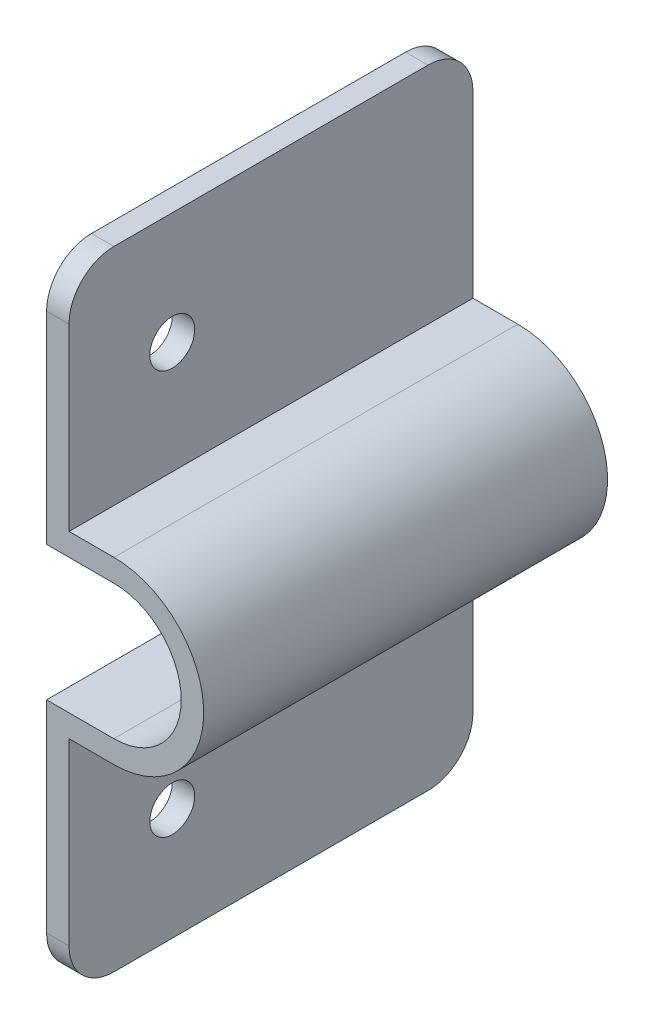
ISO-10303-21;
HEADER;
FILE_DESCRIPTION(('STEP AP214'),'2;1');
FILE_NAME('part.step','',(''),(''),'','','');
FILE_SCHEMA(('AUTOMOTIVE_DESIGN { 1 0 10303 214 1 1 1 1 }'));
ENDSEC;
DATA;
#1=APPLICATION_CONTEXT('core data for automotive mechanical design processes');
#2=APPLICATION_PROTOCOL_DEFINITION('international standard','automotive_design',2000,#1);
#3=PRODUCT_CONTEXT('',#1,'mechanical');
#4=PRODUCT('Part','Part','',(#3));
#5=PRODUCT_RELATED_PRODUCT_CATEGORY('part','',(#4));
#6=PRODUCT_DEFINITION_FORMATION('','',#4);
#7=PRODUCT_DEFINITION_CONTEXT('part definition',#1,'design');
#8=PRODUCT_DEFINITION('design','',#6,#7);
#9=PRODUCT_DEFINITION_SHAPE('','',#8);
#10=(LENGTH_UNIT() NAMED_UNIT(*) SI_UNIT(.MILLI.,.METRE.));
#11=(NAMED_UNIT(*) PLANE_ANGLE_UNIT() SI_UNIT($,.RADIAN.));
#12=(NAMED_UNIT(*) SI_UNIT($,.STERADIAN.) SOLID_ANGLE_UNIT());
#13=UNCERTAINTY_MEASURE_WITH_UNIT(LENGTH_MEASURE(1.E-05),#10,'distance_accuracy_value','');
#14=(GEOMETRIC_REPRESENTATION_CONTEXT(3) GLOBAL_UNCERTAINTY_ASSIGNED_CONTEXT((#13)) GLOBAL_UNIT_ASSIGNED_CONTEXT((#10,
#11,#12)) REPRESENTATION_CONTEXT('',''));
#15=CARTESIAN_POINT('',(0.,0.,0.));
#16=DIRECTION('',(0.,0.,1.));
#17=DIRECTION('',(1.,0.,0.));
#18=AXIS2_PLACEMENT_3D('',#15,#16,#17);
#19=CARTESIAN_POINT('',(0.,288.164397321974,-88.9));
#20=DIRECTION('',(0.,1.,0.));
#21=DIRECTION('',(0.,0.,1.));
#22=AXIS2_PLACEMENT_3D('',#19,#20,#21);
#23=PLANE('',#22);
#24=DIRECTION('',(1.,0.,0.));
#25=VECTOR('',#24,1.);
#26=CARTESIAN_POINT('',(0.,288.164397321974,-31.75));
#27=LINE('',#26,#25);
#28=CARTESIAN_POINT('',(10.1599999999996,288.164397321974,-31.75));
#29=VERTEX_POINT('',#28);
#30=CARTESIAN_POINT('',(19.6849999999996,288.164397321974,-31.75));
#31=VERTEX_POINT('',#30);
#32=EDGE_CURVE('E156',#29,#31,#27,.T.);
#33=ORIENTED_EDGE('',*,*,#32,.F.);
#34=DIRECTION('',(0.,0.,1.));
#35=VECTOR('',#34,1.);
#36=CARTESIAN_POINT('',(10.1599999999996,288.164397321974,-88.9));
#37=LINE('',#36,#35);
#38=CARTESIAN_POINT('',(10.1599999999996,288.164397321974,-88.9));
#39=VERTEX_POINT('',#38);
#40=EDGE_CURVE('E169',#39,#29,#37,.T.);
#41=ORIENTED_EDGE('',*,*,#40,.F.);
#42=DIRECTION('',(-1.,0.,0.));
#43=VECTOR('',#42,1.);
#44=CARTESIAN_POINT('',(0.,288.164397321974,-88.9));
#45=LINE('',#44,#43);
#46=CARTESIAN_POINT('',(19.6849999999996,288.164397321974,-88.9));
#47=VERTEX_POINT('',#46);
#48=EDGE_CURVE('E327',#47,#39,#45,.T.);
#49=ORIENTED_EDGE('',*,*,#48,.F.);
#50=DIRECTION('',(0.,0.,1.));
#51=VECTOR('',#50,1.);
#52=CARTESIAN_POINT('',(19.6849999999996,288.164397321974,-88.9));
#53=LINE('',#52,#51);
#54=EDGE_CURVE('E171',#47,#31,#53,.T.);
#55=ORIENTED_EDGE('',*,*,#54,.T.);
#56=EDGE_LOOP('',(#33,#41,#49,#55));
#57=FACE_BOUND('',#56,.T.);
#58=ADVANCED_FACE('F40',(#57),#23,.F.);
#59=CARTESIAN_POINT('',(10.1599999999996,0.,-88.9));
#60=DIRECTION('',(-1.,0.,0.));
#61=DIRECTION('',(0.,-1.,0.));
#62=AXIS2_PLACEMENT_3D('',#59,#60,#61);
#63=PLANE('',#62);
#64=CARTESIAN_POINT('',(10.1599999999996,307.214397321974,-46.355));
#65=DIRECTION('',(1.,0.,0.));
#66=DIRECTION('',(0.,0.,-1.));
#67=AXIS2_PLACEMENT_3D('',#64,#65,#66);
#68=CIRCLE('',#67,3.175);
#69=CARTESIAN_POINT('',(10.1599999999996,307.214397321974,-49.53));
#70=VERTEX_POINT('',#69);
#71=EDGE_CURVE('E334',#70,#70,#68,.T.);
#72=ORIENTED_EDGE('',*,*,#71,.T.);
#73=EDGE_LOOP('',(#72));
#74=FACE_BOUND('',#73,.T.);
#75=DIRECTION('',(0.,-1.,0.));
#76=VECTOR('',#75,1.);
#77=CARTESIAN_POINT('',(10.1599999999996,0.,-31.75));
#78=LINE('',#77,#76);
#79=CARTESIAN_POINT('',(10.1599999999996,316.739397321974,-31.75));
#80=VERTEX_POINT('',#79);
#81=EDGE_CURVE('E152',#80,#29,#78,.T.);
#82=ORIENTED_EDGE('',*,*,#81,.F.);
#83=CARTESIAN_POINT('',(10.1599999999996,316.739397321974,-38.1));
#84=DIRECTION('',(-1.,0.,0.));
#85=DIRECTION('',(0.,-1.,0.));
#86=AXIS2_PLACEMENT_3D('',#83,#84,#85);
#87=CIRCLE('',#86,6.35);
#88=CARTESIAN_POINT('',(10.1599999999996,323.089397321974,-38.1));
#89=VERTEX_POINT('',#88);
#90=EDGE_CURVE('E11',#80,#89,#87,.T.);
#91=ORIENTED_EDGE('',*,*,#90,.T.);
#92=DIRECTION('',(0.,0.,1.));
#93=VECTOR('',#92,1.);
#94=CARTESIAN_POINT('',(10.1599999999996,323.089397321974,-88.9));
#95=LINE('',#94,#93);
#96=CARTESIAN_POINT('',(10.1599999999996,323.089397321974,-82.55));
#97=VERTEX_POINT('',#96);
#98=EDGE_CURVE('E181',#97,#89,#95,.T.);
#99=ORIENTED_EDGE('',*,*,#98,.F.);
#100=CARTESIAN_POINT('',(10.1599999999996,316.739397321974,-82.55));
#101=DIRECTION('',(-1.,0.,0.));
#102=DIRECTION('',(0.,-1.,0.));
#103=AXIS2_PLACEMENT_3D('',#100,#101,#102);
#104=CIRCLE('',#103,6.35);
#105=CARTESIAN_POINT('',(10.1599999999996,316.739397321974,-88.9));
#106=VERTEX_POINT('',#105);
#107=EDGE_CURVE('E249',#97,#106,#104,.T.);
#108=ORIENTED_EDGE('',*,*,#107,.T.);
#109=DIRECTION('',(0.,-1.,0.));
#110=VECTOR('',#109,1.);
#111=CARTESIAN_POINT('',(10.1599999999996,0.,-88.9));
#112=LINE('',#111,#110);
#113=EDGE_CURVE('E177',#106,#39,#112,.T.);
#114=ORIENTED_EDGE('',*,*,#113,.T.);
#115=ORIENTED_EDGE('',*,*,#40,.T.);
#116=EDGE_LOOP('',(#82,#91,#99,#108,#114,#115));
#117=FACE_BOUND('',#116,.T.);
#118=ADVANCED_FACE('F175',(#74,#117),#63,.T.);
#119=CARTESIAN_POINT('',(0.,323.089397321974,-88.9));
#120=DIRECTION('',(0.,-1.,0.));
#121=DIRECTION('',(0.,0.,-1.));
#122=AXIS2_PLACEMENT_3D('',#119,#120,#121);
#123=PLANE('',#122);
#124=ORIENTED_EDGE('',*,*,#98,.T.);
#125=DIRECTION('',(1.,0.,0.));
#126=VECTOR('',#125,1.);
#127=CARTESIAN_POINT('',(13.3349999999996,323.089397321974,-38.1));
#128=LINE('',#127,#126);
#129=CARTESIAN_POINT('',(13.3349999999996,323.089397321974,-38.1));
#130=VERTEX_POINT('',#129);
#131=EDGE_CURVE('E269',#89,#130,#128,.T.);
#132=ORIENTED_EDGE('',*,*,#131,.T.);
#133=DIRECTION('',(0.,0.,1.));
#134=VECTOR('',#133,1.);
#135=CARTESIAN_POINT('',(13.3349999999996,323.089397321974,-88.9));
#136=LINE('',#135,#134);
#137=CARTESIAN_POINT('',(13.3349999999996,323.089397321974,-82.55));
#138=VERTEX_POINT('',#137);
#139=EDGE_CURVE('E189',#138,#130,#136,.T.);
#140=ORIENTED_EDGE('',*,*,#139,.F.);
#141=DIRECTION('',(1.,0.,0.));
#142=VECTOR('',#141,1.);
#143=CARTESIAN_POINT('',(0.,323.089397321974,-82.55));
#144=LINE('',#143,#142);
#145=EDGE_CURVE('E244',#138,#97,#144,.F.);
#146=ORIENTED_EDGE('',*,*,#145,.T.);
#147=EDGE_LOOP('',(#124,#132,#140,#146));
#148=FACE_BOUND('',#147,.T.);
#149=ADVANCED_FACE('F285',(#148),#123,.F.);
#150=CARTESIAN_POINT('',(13.3349999999996,0.,-88.9));
#151=DIRECTION('',(1.,0.,0.));
#152=DIRECTION('',(0.,0.,-1.));
#153=AXIS2_PLACEMENT_3D('',#150,#151,#152);
#154=PLANE('',#153);
#155=CARTESIAN_POINT('',(13.3349999999996,307.214397321974,-46.355));
#156=DIRECTION('',(1.,0.,0.));
#157=DIRECTION('',(0.,0.,-1.));
#158=AXIS2_PLACEMENT_3D('',#155,#156,#157);
#159=CIRCLE('',#158,3.175);
#160=CARTESIAN_POINT('',(13.3349999999996,307.214397321974,-49.53));
#161=VERTEX_POINT('',#160);
#162=EDGE_CURVE('E282',#161,#161,#159,.T.);
#163=ORIENTED_EDGE('',*,*,#162,.F.);
#164=EDGE_LOOP('',(#163));
#165=FACE_BOUND('',#164,.T.);
#166=ORIENTED_EDGE('',*,*,#139,.T.);
#167=CARTESIAN_POINT('',(13.3349999999996,316.739397321974,-38.1));
#168=DIRECTION('',(1.,0.,0.));
#169=DIRECTION('',(0.,0.,-1.));
#170=AXIS2_PLACEMENT_3D('',#167,#168,#169);
#171=CIRCLE('',#170,6.35);
#172=CARTESIAN_POINT('',(13.3349999999996,316.739397321974,-31.75));
#173=VERTEX_POINT('',#172);
#174=EDGE_CURVE('E49',#130,#173,#171,.T.);
#175=ORIENTED_EDGE('',*,*,#174,.T.);
#176=DIRECTION('',(0.,-1.,0.));
#177=VECTOR('',#176,1.);
#178=CARTESIAN_POINT('',(13.3349999999996,0.,-31.75));
#179=LINE('',#178,#177);
#180=CARTESIAN_POINT('',(13.3349999999996,291.339397321974,-31.75));
#181=VERTEX_POINT('',#180);
#182=EDGE_CURVE('E276',#173,#181,#179,.T.);
#183=ORIENTED_EDGE('',*,*,#182,.T.);
#184=DIRECTION('',(0.,0.,1.));
#185=VECTOR('',#184,1.);
#186=CARTESIAN_POINT('',(13.3349999999996,291.339397321974,-88.9));
#187=LINE('',#186,#185);
#188=CARTESIAN_POINT('',(13.3349999999996,291.339397321974,-88.9));
#189=VERTEX_POINT('',#188);
#190=EDGE_CURVE('E197',#189,#181,#187,.T.);
#191=ORIENTED_EDGE('',*,*,#190,.F.);
#192=DIRECTION('',(0.,1.,0.));
#193=VECTOR('',#192,1.);
#194=CARTESIAN_POINT('',(13.3349999999996,0.,-88.9));
#195=LINE('',#194,#193);
#196=CARTESIAN_POINT('',(13.3349999999996,316.739397321974,-88.9));
#197=VERTEX_POINT('',#196);
#198=EDGE_CURVE('E297',#189,#197,#195,.T.);
#199=ORIENTED_EDGE('',*,*,#198,.T.);
#200=CARTESIAN_POINT('',(13.3349999999996,316.739397321974,-82.55));
#201=DIRECTION('',(1.,0.,0.));
#202=DIRECTION('',(0.,0.,-1.));
#203=AXIS2_PLACEMENT_3D('',#200,#201,#202);
#204=CIRCLE('',#203,6.35);
#205=EDGE_CURVE('E247',#197,#138,#204,.T.);
#206=ORIENTED_EDGE('',*,*,#205,.T.);
#207=EDGE_LOOP('',(#166,#175,#183,#191,#199,#206));
#208=FACE_BOUND('',#207,.T.);
#209=ADVANCED_FACE('F275',(#165,#208),#154,.T.);
#210=CARTESIAN_POINT('',(0.,291.339397321974,-88.9));
#211=DIRECTION('',(0.,1.,0.));
#212=DIRECTION('',(0.,0.,1.));
#213=AXIS2_PLACEMENT_3D('',#210,#211,#212);
#214=PLANE('',#213);
#215=ORIENTED_EDGE('',*,*,#190,.T.);
#216=DIRECTION('',(1.,0.,0.));
#217=VECTOR('',#216,1.);
#218=CARTESIAN_POINT('',(0.,291.339397321974,-31.75));
#219=LINE('',#218,#217);
#220=CARTESIAN_POINT('',(19.6849999999996,291.339397321974,-31.75));
#221=VERTEX_POINT('',#220);
#222=EDGE_CURVE('E280',#181,#221,#219,.T.);
#223=ORIENTED_EDGE('',*,*,#222,.T.);
#224=DIRECTION('',(0.,0.,1.));
#225=VECTOR('',#224,1.);
#226=CARTESIAN_POINT('',(19.6849999999996,291.339397321974,-88.9));
#227=LINE('',#226,#225);
#228=CARTESIAN_POINT('',(19.6849999999996,291.339397321974,-88.9));
#229=VERTEX_POINT('',#228);
#230=EDGE_CURVE('E201',#229,#221,#227,.T.);
#231=ORIENTED_EDGE('',*,*,#230,.F.);
#232=DIRECTION('',(-1.,0.,0.));
#233=VECTOR('',#232,1.);
#234=CARTESIAN_POINT('',(0.,291.339397321974,-88.9));
#235=LINE('',#234,#233);
#236=EDGE_CURVE('E300',#229,#189,#235,.T.);
#237=ORIENTED_EDGE('',*,*,#236,.T.);
#238=EDGE_LOOP('',(#215,#223,#231,#237));
#239=FACE_BOUND('',#238,.T.);
#240=ADVANCED_FACE('F393',(#239),#214,.T.);
#241=CARTESIAN_POINT('',(19.6849999999996,278.639397321974,-88.9));
#242=DIRECTION('',(0.,0.,1.));
#243=DIRECTION('',(1.,0.,0.));
#244=AXIS2_PLACEMENT_3D('',#241,#242,#243);
#245=CYLINDRICAL_SURFACE('',#244,12.7);
#246=ORIENTED_EDGE('',*,*,#230,.T.);
#247=CARTESIAN_POINT('',(19.6849999999996,278.639397321974,-31.75));
#248=DIRECTION('',(0.,0.,1.));
#249=DIRECTION('',(0.,-1.,0.));
#250=AXIS2_PLACEMENT_3D('',#247,#248,#249);
#251=CIRCLE('',#250,12.7);
#252=CARTESIAN_POINT('',(19.6849999999996,265.939397321974,-31.75));
#253=VERTEX_POINT('',#252);
#254=EDGE_CURVE('E346',#221,#253,#251,.F.);
#255=ORIENTED_EDGE('',*,*,#254,.T.);
#256=DIRECTION('',(0.,0.,1.));
#257=VECTOR('',#256,1.);
#258=CARTESIAN_POINT('',(19.6849999999996,265.939397321974,-88.9));
#259=LINE('',#258,#257);
#260=CARTESIAN_POINT('',(19.6849999999996,265.939397321974,-88.9));
#261=VERTEX_POINT('',#260);
#262=EDGE_CURVE('E205',#261,#253,#259,.T.);
#263=ORIENTED_EDGE('',*,*,#262,.F.);
#264=CARTESIAN_POINT('',(19.6849999999996,278.639397321974,-88.9));
#265=DIRECTION('',(0.,0.,1.));
#266=DIRECTION('',(1.,0.,0.));
#267=AXIS2_PLACEMENT_3D('',#264,#265,#266);
#268=CIRCLE('',#267,12.7);
#269=EDGE_CURVE('E303',#261,#229,#268,.T.);
#270=ORIENTED_EDGE('',*,*,#269,.T.);
#271=EDGE_LOOP('',(#246,#255,#263,#270));
#272=FACE_BOUND('',#271,.T.);
#273=ADVANCED_FACE('F391',(#272),#245,.T.);
#274=CARTESIAN_POINT('',(0.,265.939397321974,-88.9));
#275=DIRECTION('',(0.,1.,0.));
#276=DIRECTION('',(0.,0.,1.));
#277=AXIS2_PLACEMENT_3D('',#274,#275,#276);
#278=PLANE('',#277);
#279=DIRECTION('',(1.,0.,0.));
#280=VECTOR('',#279,1.);
#281=CARTESIAN_POINT('',(0.,265.939397321974,-31.75));
#282=LINE('',#281,#280);
#283=CARTESIAN_POINT('',(13.3349999999996,265.939397321974,-31.75));
#284=VERTEX_POINT('',#283);
#285=EDGE_CURVE('E348',#284,#253,#282,.T.);
#286=ORIENTED_EDGE('',*,*,#285,.F.);
#287=DIRECTION('',(0.,0.,1.));
#288=VECTOR('',#287,1.);
#289=CARTESIAN_POINT('',(13.3349999999996,265.939397321974,-88.9));
#290=LINE('',#289,#288);
#291=CARTESIAN_POINT('',(13.3349999999996,265.939397321974,-88.9));
#292=VERTEX_POINT('',#291);
#293=EDGE_CURVE('E209',#292,#284,#290,.T.);
#294=ORIENTED_EDGE('',*,*,#293,.F.);
#295=DIRECTION('',(-1.,0.,0.));
#296=VECTOR('',#295,1.);
#297=CARTESIAN_POINT('',(0.,265.939397321974,-88.9));
#298=LINE('',#297,#296);
#299=EDGE_CURVE('E309',#261,#292,#298,.T.);
#300=ORIENTED_EDGE('',*,*,#299,.F.);
#301=ORIENTED_EDGE('',*,*,#262,.T.);
#302=EDGE_LOOP('',(#286,#294,#300,#301));
#303=FACE_BOUND('',#302,.T.);
#304=ADVANCED_FACE('F387',(#303),#278,.F.);
#305=CARTESIAN_POINT('',(13.3349999999996,0.,-88.9));
#306=DIRECTION('',(1.,0.,0.));
#307=DIRECTION('',(0.,0.,-1.));
#308=AXIS2_PLACEMENT_3D('',#305,#306,#307);
#309=PLANE('',#308);
#310=CARTESIAN_POINT('',(13.3349999999996,250.064397321974,-46.355));
#311=DIRECTION('',(1.,0.,0.));
#312=DIRECTION('',(0.,0.,-1.));
#313=AXIS2_PLACEMENT_3D('',#310,#311,#312);
#314=CIRCLE('',#313,3.175);
#315=CARTESIAN_POINT('',(13.3349999999996,250.064397321974,-49.53));
#316=VERTEX_POINT('',#315);
#317=EDGE_CURVE('E337',#316,#316,#314,.T.);
#318=ORIENTED_EDGE('',*,*,#317,.F.);
#319=EDGE_LOOP('',(#318));
#320=FACE_BOUND('',#319,.T.);
#321=DIRECTION('',(0.,-1.,0.));
#322=VECTOR('',#321,1.);
#323=CARTESIAN_POINT('',(13.3349999999996,0.,-31.75));
#324=LINE('',#323,#322);
#325=CARTESIAN_POINT('',(13.3349999999996,240.539397321974,-31.75));
#326=VERTEX_POINT('',#325);
#327=EDGE_CURVE('E173',#284,#326,#324,.T.);
#328=ORIENTED_EDGE('',*,*,#327,.T.);
#329=CARTESIAN_POINT('',(13.3349999999996,240.539397321974,-38.1));
#330=DIRECTION('',(1.,0.,0.));
#331=DIRECTION('',(0.,0.,-1.));
#332=AXIS2_PLACEMENT_3D('',#329,#330,#331);
#333=CIRCLE('',#332,6.35);
#334=CARTESIAN_POINT('',(13.3349999999996,234.189397321974,-38.1));
#335=VERTEX_POINT('',#334);
#336=EDGE_CURVE('E261',#326,#335,#333,.T.);
#337=ORIENTED_EDGE('',*,*,#336,.T.);
#338=DIRECTION('',(0.,0.,1.));
#339=VECTOR('',#338,1.);
#340=CARTESIAN_POINT('',(13.3349999999996,234.189397321974,-88.9));
#341=LINE('',#340,#339);
#342=CARTESIAN_POINT('',(13.3349999999996,234.189397321974,-82.55));
#343=VERTEX_POINT('',#342);
#344=EDGE_CURVE('E213',#343,#335,#341,.T.);
#345=ORIENTED_EDGE('',*,*,#344,.F.);
#346=CARTESIAN_POINT('',(13.3349999999996,240.539397321974,-82.55));
#347=DIRECTION('',(1.,0.,0.));
#348=DIRECTION('',(0.,0.,-1.));
#349=AXIS2_PLACEMENT_3D('',#346,#347,#348);
#350=CIRCLE('',#349,6.35);
#351=CARTESIAN_POINT('',(13.3349999999996,240.539397321974,-88.9));
#352=VERTEX_POINT('',#351);
#353=EDGE_CURVE('E180',#343,#352,#350,.T.);
#354=ORIENTED_EDGE('',*,*,#353,.T.);
#355=DIRECTION('',(0.,1.,0.));
#356=VECTOR('',#355,1.);
#357=CARTESIAN_POINT('',(13.3349999999996,0.,-88.9));
#358=LINE('',#357,#356);
#359=EDGE_CURVE('E313',#352,#292,#358,.T.);
#360=ORIENTED_EDGE('',*,*,#359,.T.);
#361=ORIENTED_EDGE('',*,*,#293,.T.);
#362=EDGE_LOOP('',(#328,#337,#345,#354,#360,#361));
#363=FACE_BOUND('',#362,.T.);
#364=ADVANCED_FACE('F378',(#320,#363),#309,.T.);
#365=CARTESIAN_POINT('',(0.,234.189397321974,-88.9));
#366=DIRECTION('',(0.,-1.,0.));
#367=DIRECTION('',(0.,0.,-1.));
#368=AXIS2_PLACEMENT_3D('',#365,#366,#367);
#369=PLANE('',#368);
#370=ORIENTED_EDGE('',*,*,#344,.T.);
#371=DIRECTION('',(1.,0.,0.));
#372=VECTOR('',#371,1.);
#373=CARTESIAN_POINT('',(0.,234.189397321974,-38.1));
#374=LINE('',#373,#372);
#375=CARTESIAN_POINT('',(10.1599999999996,234.189397321974,-38.1));
#376=VERTEX_POINT('',#375);
#377=EDGE_CURVE('E263',#335,#376,#374,.F.);
#378=ORIENTED_EDGE('',*,*,#377,.T.);
#379=DIRECTION('',(0.,0.,1.));
#380=VECTOR('',#379,1.);
#381=CARTESIAN_POINT('',(10.1599999999996,234.189397321974,-88.9));
#382=LINE('',#381,#380);
#383=CARTESIAN_POINT('',(10.1599999999996,234.189397321974,-82.55));
#384=VERTEX_POINT('',#383);
#385=EDGE_CURVE('E217',#384,#376,#382,.T.);
#386=ORIENTED_EDGE('',*,*,#385,.F.);
#387=DIRECTION('',(1.,0.,0.));
#388=VECTOR('',#387,1.);
#389=CARTESIAN_POINT('',(13.3349999999996,234.189397321974,-82.55));
#390=LINE('',#389,#388);
#391=EDGE_CURVE('E186',#384,#343,#390,.T.);
#392=ORIENTED_EDGE('',*,*,#391,.T.);
#393=EDGE_LOOP('',(#370,#378,#386,#392));
#394=FACE_BOUND('',#393,.T.);
#395=ADVANCED_FACE('F375',(#394),#369,.T.);
#396=CARTESIAN_POINT('',(10.1599999999996,0.,-88.9));
#397=DIRECTION('',(-1.,0.,0.));
#398=DIRECTION('',(0.,-1.,0.));
#399=AXIS2_PLACEMENT_3D('',#396,#397,#398);
#400=PLANE('',#399);
#401=CARTESIAN_POINT('',(10.1599999999996,250.064397321974,-46.355));
#402=DIRECTION('',(1.,0.,0.));
#403=DIRECTION('',(0.,0.,-1.));
#404=AXIS2_PLACEMENT_3D('',#401,#402,#403);
#405=CIRCLE('',#404,3.175);
#406=CARTESIAN_POINT('',(10.1599999999996,250.064397321974,-49.53));
#407=VERTEX_POINT('',#406);
#408=EDGE_CURVE('E330',#407,#407,#405,.T.);
#409=ORIENTED_EDGE('',*,*,#408,.T.);
#410=EDGE_LOOP('',(#409));
#411=FACE_BOUND('',#410,.T.);
#412=ORIENTED_EDGE('',*,*,#385,.T.);
#413=CARTESIAN_POINT('',(10.1599999999996,240.539397321974,-38.1));
#414=DIRECTION('',(-1.,0.,0.));
#415=DIRECTION('',(0.,-1.,0.));
#416=AXIS2_PLACEMENT_3D('',#413,#414,#415);
#417=CIRCLE('',#416,6.35);
#418=CARTESIAN_POINT('',(10.1599999999996,240.539397321974,-31.75));
#419=VERTEX_POINT('',#418);
#420=EDGE_CURVE('E266',#376,#419,#417,.T.);
#421=ORIENTED_EDGE('',*,*,#420,.T.);
#422=CARTESIAN_POINT('',(10.1599999999996,269.114397321974,-31.75));
#423=VERTEX_POINT('',#422);
#424=EDGE_CURVE('E163',#423,#419,#78,.T.);
#425=ORIENTED_EDGE('',*,*,#424,.F.);
#426=DIRECTION('',(0.,0.,1.));
#427=VECTOR('',#426,1.);
#428=CARTESIAN_POINT('',(10.1599999999996,269.114397321974,-88.9));
#429=LINE('',#428,#427);
#430=CARTESIAN_POINT('',(10.1599999999996,269.114397321974,-88.9));
#431=VERTEX_POINT('',#430);
#432=EDGE_CURVE('E221',#431,#423,#429,.T.);
#433=ORIENTED_EDGE('',*,*,#432,.F.);
#434=DIRECTION('',(0.,-1.,0.));
#435=VECTOR('',#434,1.);
#436=CARTESIAN_POINT('',(10.1599999999996,0.,-88.9));
#437=LINE('',#436,#435);
#438=CARTESIAN_POINT('',(10.1599999999996,240.539397321974,-88.9));
#439=VERTEX_POINT('',#438);
#440=EDGE_CURVE('E316',#431,#439,#437,.T.);
#441=ORIENTED_EDGE('',*,*,#440,.T.);
#442=CARTESIAN_POINT('',(10.1599999999996,240.539397321974,-82.55));
#443=DIRECTION('',(-1.,0.,0.));
#444=DIRECTION('',(0.,-1.,0.));
#445=AXIS2_PLACEMENT_3D('',#442,#443,#444);
#446=CIRCLE('',#445,6.35);
#447=EDGE_CURVE('E234',#439,#384,#446,.T.);
#448=ORIENTED_EDGE('',*,*,#447,.T.);
#449=EDGE_LOOP('',(#412,#421,#425,#433,#441,#448));
#450=FACE_BOUND('',#449,.T.);
#451=ADVANCED_FACE('F368',(#411,#450),#400,.T.);
#452=CARTESIAN_POINT('',(0.,269.114397321974,-88.9));
#453=DIRECTION('',(0.,1.,0.));
#454=DIRECTION('',(0.,0.,1.));
#455=AXIS2_PLACEMENT_3D('',#452,#453,#454);
#456=PLANE('',#455);
#457=ORIENTED_EDGE('',*,*,#432,.T.);
#458=DIRECTION('',(1.,0.,0.));
#459=VECTOR('',#458,1.);
#460=CARTESIAN_POINT('',(0.,269.114397321974,-31.75));
#461=LINE('',#460,#459);
#462=CARTESIAN_POINT('',(19.6849999999996,269.114397321974,-31.75));
#463=VERTEX_POINT('',#462);
#464=EDGE_CURVE('E162',#423,#463,#461,.T.);
#465=ORIENTED_EDGE('',*,*,#464,.T.);
#466=DIRECTION('',(0.,0.,1.));
#467=VECTOR('',#466,1.);
#468=CARTESIAN_POINT('',(19.6849999999996,269.114397321974,-88.9));
#469=LINE('',#468,#467);
#470=CARTESIAN_POINT('',(19.6849999999996,269.114397321974,-88.9));
#471=VERTEX_POINT('',#470);
#472=EDGE_CURVE('E225',#471,#463,#469,.T.);
#473=ORIENTED_EDGE('',*,*,#472,.F.);
#474=DIRECTION('',(-1.,0.,0.));
#475=VECTOR('',#474,1.);
#476=CARTESIAN_POINT('',(0.,269.114397321974,-88.9));
#477=LINE('',#476,#475);
#478=EDGE_CURVE('E320',#471,#431,#477,.T.);
#479=ORIENTED_EDGE('',*,*,#478,.T.);
#480=EDGE_LOOP('',(#457,#465,#473,#479));
#481=FACE_BOUND('',#480,.T.);
#482=ADVANCED_FACE('F358',(#481),#456,.T.);
#483=CARTESIAN_POINT('',(19.6849999999996,278.639397321974,-88.9));
#484=DIRECTION('',(0.,0.,1.));
#485=DIRECTION('',(1.,0.,0.));
#486=AXIS2_PLACEMENT_3D('',#483,#484,#485);
#487=CYLINDRICAL_SURFACE('',#486,9.525);
#488=CARTESIAN_POINT('',(19.6849999999996,278.639397321974,-31.75));
#489=DIRECTION('',(0.,0.,1.));
#490=DIRECTION('',(0.,-1.,0.));
#491=AXIS2_PLACEMENT_3D('',#488,#489,#490);
#492=CIRCLE('',#491,9.525);
#493=EDGE_CURVE('E252',#31,#463,#492,.F.);
#494=ORIENTED_EDGE('',*,*,#493,.F.);
#495=ORIENTED_EDGE('',*,*,#54,.F.);
#496=CARTESIAN_POINT('',(19.6849999999996,278.639397321974,-88.9));
#497=DIRECTION('',(0.,0.,1.));
#498=DIRECTION('',(1.,0.,0.));
#499=AXIS2_PLACEMENT_3D('',#496,#497,#498);
#500=CIRCLE('',#499,9.525);
#501=EDGE_CURVE('E324',#471,#47,#500,.T.);
#502=ORIENTED_EDGE('',*,*,#501,.F.);
#503=ORIENTED_EDGE('',*,*,#472,.T.);
#504=EDGE_LOOP('',(#494,#495,#502,#503));
#505=FACE_BOUND('',#504,.T.);
#506=ADVANCED_FACE('F362',(#505),#487,.F.);
#507=CARTESIAN_POINT('',(0.,0.,-88.9));
#508=DIRECTION('',(0.,0.,1.));
#509=DIRECTION('',(1.,0.,0.));
#510=AXIS2_PLACEMENT_3D('',#507,#508,#509);
#511=PLANE('',#510);
#512=ORIENTED_EDGE('',*,*,#359,.F.);
#513=DIRECTION('',(1.,0.,0.));
#514=VECTOR('',#513,1.);
#515=CARTESIAN_POINT('',(10.1599999999996,240.539397321974,-88.9));
#516=LINE('',#515,#514);
#517=EDGE_CURVE('E241',#352,#439,#516,.F.);
#518=ORIENTED_EDGE('',*,*,#517,.T.);
#519=ORIENTED_EDGE('',*,*,#440,.F.);
#520=ORIENTED_EDGE('',*,*,#478,.F.);
#521=ORIENTED_EDGE('',*,*,#501,.T.);
#522=ORIENTED_EDGE('',*,*,#48,.T.);
#523=ORIENTED_EDGE('',*,*,#113,.F.);
#524=DIRECTION('',(1.,0.,0.));
#525=VECTOR('',#524,1.);
#526=CARTESIAN_POINT('',(0.,316.739397321974,-88.9));
#527=LINE('',#526,#525);
#528=EDGE_CURVE('E237',#106,#197,#527,.T.);
#529=ORIENTED_EDGE('',*,*,#528,.T.);
#530=ORIENTED_EDGE('',*,*,#198,.F.);
#531=ORIENTED_EDGE('',*,*,#236,.F.);
#532=ORIENTED_EDGE('',*,*,#269,.F.);
#533=ORIENTED_EDGE('',*,*,#299,.T.);
#534=EDGE_LOOP('',(#512,#518,#519,#520,#521,#522,#523,#529,#530,#531,#532,#533));
#535=FACE_BOUND('',#534,.T.);
#536=ADVANCED_FACE('F295',(#535),#511,.F.);
#537=CARTESIAN_POINT('',(10.1599999999996,250.064397321974,-46.355));
#538=DIRECTION('',(1.,0.,0.));
#539=DIRECTION('',(0.,0.,-1.));
#540=AXIS2_PLACEMENT_3D('',#537,#538,#539);
#541=CYLINDRICAL_SURFACE('',#540,3.175);
#542=ORIENTED_EDGE('',*,*,#408,.F.);
#543=EDGE_LOOP('',(#542));
#544=FACE_BOUND('',#543,.T.);
#545=ORIENTED_EDGE('',*,*,#317,.T.);
#546=EDGE_LOOP('',(#545));
#547=FACE_BOUND('',#546,.T.);
#548=ADVANCED_FACE('F426',(#544,#547),#541,.F.);
#549=CARTESIAN_POINT('',(10.1599999999996,307.214397321974,-46.355));
#550=DIRECTION('',(1.,0.,0.));
#551=DIRECTION('',(0.,0.,-1.));
#552=AXIS2_PLACEMENT_3D('',#549,#550,#551);
#553=CYLINDRICAL_SURFACE('',#552,3.175);
#554=ORIENTED_EDGE('',*,*,#71,.F.);
#555=EDGE_LOOP('',(#554));
#556=FACE_BOUND('',#555,.T.);
#557=ORIENTED_EDGE('',*,*,#162,.T.);
#558=EDGE_LOOP('',(#557));
#559=FACE_BOUND('',#558,.T.);
#560=ADVANCED_FACE('F415',(#556,#559),#553,.F.);
#561=CARTESIAN_POINT('',(0.,240.539397321974,-82.55));
#562=DIRECTION('',(-1.,0.,0.));
#563=DIRECTION('',(0.,0.,1.));
#564=AXIS2_PLACEMENT_3D('',#561,#562,#563);
#565=CYLINDRICAL_SURFACE('',#564,6.35);
#566=ORIENTED_EDGE('',*,*,#447,.F.);
#567=ORIENTED_EDGE('',*,*,#517,.F.);
#568=ORIENTED_EDGE('',*,*,#353,.F.);
#569=ORIENTED_EDGE('',*,*,#391,.F.);
#570=EDGE_LOOP('',(#566,#567,#568,#569));
#571=FACE_BOUND('',#570,.T.);
#572=ADVANCED_FACE('F372',(#571),#565,.T.);
#573=CARTESIAN_POINT('',(0.,316.739397321974,-82.55));
#574=DIRECTION('',(1.,0.,0.));
#575=DIRECTION('',(0.,0.,-1.));
#576=AXIS2_PLACEMENT_3D('',#573,#574,#575);
#577=CYLINDRICAL_SURFACE('',#576,6.35);
#578=ORIENTED_EDGE('',*,*,#107,.F.);
#579=ORIENTED_EDGE('',*,*,#145,.F.);
#580=ORIENTED_EDGE('',*,*,#205,.F.);
#581=ORIENTED_EDGE('',*,*,#528,.F.);
#582=EDGE_LOOP('',(#578,#579,#580,#581));
#583=FACE_BOUND('',#582,.T.);
#584=ADVANCED_FACE('F290',(#583),#577,.T.);
#585=CARTESIAN_POINT('',(10.1599999999996,0.,-31.75));
#586=DIRECTION('',(0.,0.,1.));
#587=DIRECTION('',(0.,-1.,0.));
#588=AXIS2_PLACEMENT_3D('',#585,#586,#587);
#589=PLANE('',#588);
#590=ORIENTED_EDGE('',*,*,#424,.T.);
#591=DIRECTION('',(1.,0.,0.));
#592=VECTOR('',#591,1.);
#593=CARTESIAN_POINT('',(10.1599999999996,240.539397321974,-31.75));
#594=LINE('',#593,#592);
#595=EDGE_CURVE('E257',#419,#326,#594,.T.);
#596=ORIENTED_EDGE('',*,*,#595,.T.);
#597=ORIENTED_EDGE('',*,*,#327,.F.);
#598=ORIENTED_EDGE('',*,*,#285,.T.);
#599=ORIENTED_EDGE('',*,*,#254,.F.);
#600=ORIENTED_EDGE('',*,*,#222,.F.);
#601=ORIENTED_EDGE('',*,*,#182,.F.);
#602=DIRECTION('',(1.,0.,0.));
#603=VECTOR('',#602,1.);
#604=CARTESIAN_POINT('',(10.1599999999996,316.739397321974,-31.75));
#605=LINE('',#604,#603);
#606=EDGE_CURVE('E159',#173,#80,#605,.F.);
#607=ORIENTED_EDGE('',*,*,#606,.T.);
#608=ORIENTED_EDGE('',*,*,#81,.T.);
#609=ORIENTED_EDGE('',*,*,#32,.T.);
#610=ORIENTED_EDGE('',*,*,#493,.T.);
#611=ORIENTED_EDGE('',*,*,#464,.F.);
#612=EDGE_LOOP('',(#590,#596,#597,#598,#599,#600,#601,#607,#608,#609,#610,#611));
#613=FACE_BOUND('',#612,.T.);
#614=ADVANCED_FACE('F155',(#613),#589,.T.);
#615=CARTESIAN_POINT('',(10.1599999999996,240.539397321974,-38.1));
#616=DIRECTION('',(1.,0.,0.));
#617=DIRECTION('',(0.,0.,-1.));
#618=AXIS2_PLACEMENT_3D('',#615,#616,#617);
#619=CYLINDRICAL_SURFACE('',#618,6.35);
#620=ORIENTED_EDGE('',*,*,#420,.F.);
#621=ORIENTED_EDGE('',*,*,#377,.F.);
#622=ORIENTED_EDGE('',*,*,#336,.F.);
#623=ORIENTED_EDGE('',*,*,#595,.F.);
#624=EDGE_LOOP('',(#620,#621,#622,#623));
#625=FACE_BOUND('',#624,.T.);
#626=ADVANCED_FACE('F382',(#625),#619,.T.);
#627=CARTESIAN_POINT('',(0.,316.739397321974,-38.1));
#628=DIRECTION('',(-1.,0.,0.));
#629=DIRECTION('',(0.,0.,1.));
#630=AXIS2_PLACEMENT_3D('',#627,#628,#629);
#631=CYLINDRICAL_SURFACE('',#630,6.35);
#632=ORIENTED_EDGE('',*,*,#90,.F.);
#633=ORIENTED_EDGE('',*,*,#606,.F.);
#634=ORIENTED_EDGE('',*,*,#174,.F.);
#635=ORIENTED_EDGE('',*,*,#131,.F.);
#636=EDGE_LOOP('',(#632,#633,#634,#635));
#637=FACE_BOUND('',#636,.T.);
#638=ADVANCED_FACE('F42',(#637),#631,.T.);
#639=CLOSED_SHELL('',(#58,#118,#149,#209,#240,#273,#304,#364,#395,#451,#482,#506,#536,#548,#560,
#572,#584,#614,#626,#638));
#640=MANIFOLD_SOLID_BREP('B2',#639);
#641=ADVANCED_BREP_SHAPE_REPRESENTATION('',(#18,#640),#14);
#642=SHAPE_DEFINITION_REPRESENTATION(#9,#641);
ENDSEC;
END-ISO-10303-21;
